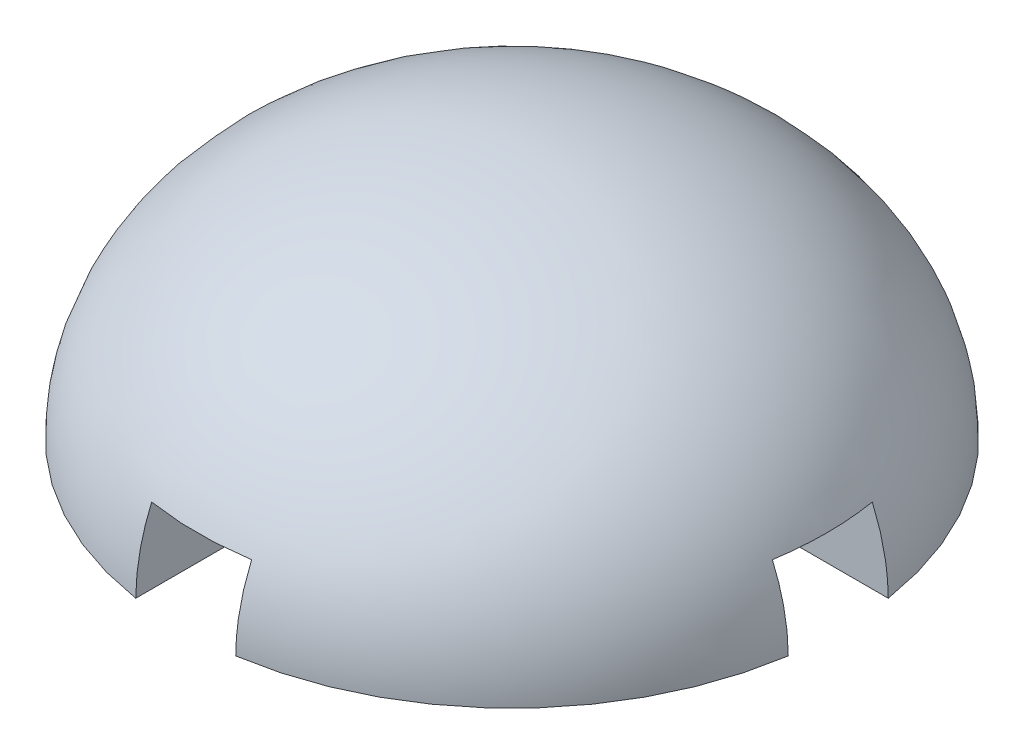
ISO-10303-21;
HEADER;
FILE_DESCRIPTION(('STEP AP214'),'2;1');
FILE_NAME('part.step','',(''),(''),'','','');
FILE_SCHEMA(('AUTOMOTIVE_DESIGN { 1 0 10303 214 1 1 1 1 }'));
ENDSEC;
DATA;
#1=APPLICATION_CONTEXT('core data for automotive mechanical design processes');
#2=APPLICATION_PROTOCOL_DEFINITION('international standard','automotive_design',2000,#1);
#3=PRODUCT_CONTEXT('',#1,'mechanical');
#4=PRODUCT('Part','Part','',(#3));
#5=PRODUCT_RELATED_PRODUCT_CATEGORY('part','',(#4));
#6=PRODUCT_DEFINITION_FORMATION('','',#4);
#7=PRODUCT_DEFINITION_CONTEXT('part definition',#1,'design');
#8=PRODUCT_DEFINITION('design','',#6,#7);
#9=PRODUCT_DEFINITION_SHAPE('','',#8);
#10=(LENGTH_UNIT() NAMED_UNIT(*) SI_UNIT(.MILLI.,.METRE.));
#11=(NAMED_UNIT(*) PLANE_ANGLE_UNIT() SI_UNIT($,.RADIAN.));
#12=(NAMED_UNIT(*) SI_UNIT($,.STERADIAN.) SOLID_ANGLE_UNIT());
#13=UNCERTAINTY_MEASURE_WITH_UNIT(LENGTH_MEASURE(1.E-05),#10,'distance_accuracy_value','');
#14=(GEOMETRIC_REPRESENTATION_CONTEXT(3) GLOBAL_UNCERTAINTY_ASSIGNED_CONTEXT((#13)) GLOBAL_UNIT_ASSIGNED_CONTEXT((#10,
#11,#12)) REPRESENTATION_CONTEXT('',''));
#15=CARTESIAN_POINT('',(0.,0.,0.));
#16=DIRECTION('',(0.,0.,1.));
#17=DIRECTION('',(1.,0.,0.));
#18=AXIS2_PLACEMENT_3D('',#15,#16,#17);
#19=CARTESIAN_POINT('',(17.5,1.640625,0.));
#20=DIRECTION('',(0.,-1.,0.));
#21=DIRECTION('',(0.,0.,-1.));
#22=AXIS2_PLACEMENT_3D('',#19,#20,#21);
#23=PLANE('',#22);
#24=CARTESIAN_POINT('',(0.,1.640625,0.));
#25=DIRECTION('',(0.,-1.,0.));
#26=DIRECTION('',(0.,0.,-1.));
#27=AXIS2_PLACEMENT_3D('',#24,#25,#26);
#28=CIRCLE('',#27,17.5);
#29=CARTESIAN_POINT('',(2.65,1.640625,-17.2981935473043));
#30=VERTEX_POINT('',#29);
#31=CARTESIAN_POINT('',(17.2981935473043,1.640625,-2.65000000000006));
#32=VERTEX_POINT('',#31);
#33=EDGE_CURVE('E150',#30,#32,#28,.T.);
#34=ORIENTED_EDGE('',*,*,#33,.T.);
#35=DIRECTION('',(-1.,0.,0.));
#36=VECTOR('',#35,1.);
#37=CARTESIAN_POINT('',(17.5,1.640625,-2.65000000000006));
#38=LINE('',#37,#36);
#39=CARTESIAN_POINT('',(2.65,1.640625,-2.65000000000001));
#40=VERTEX_POINT('',#39);
#41=EDGE_CURVE('E264',#32,#40,#38,.T.);
#42=ORIENTED_EDGE('',*,*,#41,.T.);
#43=DIRECTION('',(0.,0.,-1.));
#44=VECTOR('',#43,1.);
#45=CARTESIAN_POINT('',(2.65,1.640625,17.5));
#46=LINE('',#45,#44);
#47=EDGE_CURVE('E164',#40,#30,#46,.T.);
#48=ORIENTED_EDGE('',*,*,#47,.T.);
#49=EDGE_LOOP('',(#34,#42,#48));
#50=FACE_BOUND('',#49,.T.);
#51=ADVANCED_FACE('F35',(#50),#23,.T.);
#52=CARTESIAN_POINT('',(2.65,1.640625,17.2981935473043));
#53=VERTEX_POINT('',#52);
#54=CARTESIAN_POINT('',(2.65,1.640625,2.64999999999999));
#55=VERTEX_POINT('',#54);
#56=EDGE_CURVE('E144',#53,#55,#46,.T.);
#57=ORIENTED_EDGE('',*,*,#56,.T.);
#58=DIRECTION('',(-1.,0.,0.));
#59=VECTOR('',#58,1.);
#60=CARTESIAN_POINT('',(17.5,1.640625,2.64999999999994));
#61=LINE('',#60,#59);
#62=CARTESIAN_POINT('',(17.2981935473043,1.640625,2.64999999999994));
#63=VERTEX_POINT('',#62);
#64=EDGE_CURVE('E53',#63,#55,#61,.T.);
#65=ORIENTED_EDGE('',*,*,#64,.F.);
#66=EDGE_CURVE('E142',#63,#53,#28,.T.);
#67=ORIENTED_EDGE('',*,*,#66,.T.);
#68=EDGE_LOOP('',(#57,#65,#67));
#69=FACE_BOUND('',#68,.T.);
#70=ADVANCED_FACE('F141',(#69),#23,.T.);
#71=DIRECTION('',(0.,0.,-1.));
#72=VECTOR('',#71,1.);
#73=CARTESIAN_POINT('',(-2.65,1.640625,17.5));
#74=LINE('',#73,#72);
#75=CARTESIAN_POINT('',(-2.65,1.640625,-2.64999999999999));
#76=VERTEX_POINT('',#75);
#77=CARTESIAN_POINT('',(-2.65,1.640625,-17.2981935473043));
#78=VERTEX_POINT('',#77);
#79=EDGE_CURVE('E177',#76,#78,#74,.T.);
#80=ORIENTED_EDGE('',*,*,#79,.F.);
#81=CARTESIAN_POINT('',(-17.2981935473043,1.640625,-2.64999999999994));
#82=VERTEX_POINT('',#81);
#83=EDGE_CURVE('E308',#76,#82,#38,.T.);
#84=ORIENTED_EDGE('',*,*,#83,.T.);
#85=EDGE_CURVE('E153',#82,#78,#28,.T.);
#86=ORIENTED_EDGE('',*,*,#85,.T.);
#87=EDGE_LOOP('',(#80,#84,#86));
#88=FACE_BOUND('',#87,.T.);
#89=ADVANCED_FACE('F248',(#88),#23,.T.);
#90=CARTESIAN_POINT('',(-2.65,1.640625,17.2981935473043));
#91=VERTEX_POINT('',#90);
#92=CARTESIAN_POINT('',(-17.2981935473043,1.640625,2.65000000000006));
#93=VERTEX_POINT('',#92);
#94=EDGE_CURVE('E151',#91,#93,#28,.T.);
#95=ORIENTED_EDGE('',*,*,#94,.T.);
#96=CARTESIAN_POINT('',(-2.65,1.640625,2.65000000000001));
#97=VERTEX_POINT('',#96);
#98=EDGE_CURVE('E145',#97,#93,#61,.T.);
#99=ORIENTED_EDGE('',*,*,#98,.F.);
#100=EDGE_CURVE('E174',#91,#97,#74,.T.);
#101=ORIENTED_EDGE('',*,*,#100,.F.);
#102=EDGE_LOOP('',(#95,#99,#101));
#103=FACE_BOUND('',#102,.T.);
#104=ADVANCED_FACE('F244',(#103),#23,.T.);
#105=CARTESIAN_POINT('',(0.,-11.484375,0.));
#106=CARTESIAN_POINT('',(0.,-11.484375,0.));
#107=CARTESIAN_POINT('',(0.,-11.484375,0.));
#108=CARTESIAN_POINT('',(0.,-11.484375,0.));
#109=CARTESIAN_POINT('',(0.,-11.484375,0.));
#110=CARTESIAN_POINT('',(0.,-11.484375,0.));
#111=CARTESIAN_POINT('',(0.,-11.484375,0.));
#112=CARTESIAN_POINT('',(35.,-11.484375,0.));
#113=CARTESIAN_POINT('',(35.,-11.484375,70.));
#114=CARTESIAN_POINT('',(-35.,-11.484375,70.));
#115=CARTESIAN_POINT('',(-35.,-11.484375,0.));
#116=CARTESIAN_POINT('',(-35.,-11.484375,-70.));
#117=CARTESIAN_POINT('',(35.,-11.484375,-70.));
#118=CARTESIAN_POINT('',(35.,-11.484375,0.));
#119=CARTESIAN_POINT('',(35.,14.765625,0.));
#120=CARTESIAN_POINT('',(35.,14.765625,70.));
#121=CARTESIAN_POINT('',(-35.,14.765625,70.));
#122=CARTESIAN_POINT('',(-35.,14.765625,0.));
#123=CARTESIAN_POINT('',(-35.,14.765625,-70.));
#124=CARTESIAN_POINT('',(35.,14.765625,-70.));
#125=CARTESIAN_POINT('',(35.,14.765625,0.));
#126=CARTESIAN_POINT('',(0.,14.765625,0.));
#127=CARTESIAN_POINT('',(0.,14.765625,0.));
#128=CARTESIAN_POINT('',(0.,14.765625,0.));
#129=CARTESIAN_POINT('',(0.,14.765625,0.));
#130=CARTESIAN_POINT('',(0.,14.765625,0.));
#131=CARTESIAN_POINT('',(0.,14.765625,0.));
#132=CARTESIAN_POINT('',(0.,14.765625,0.));
#133=(BOUNDED_SURFACE() B_SPLINE_SURFACE(3,3,((#105,#106,#107,#108,#109,#110,#111),(#112,#113,
#114,#115,#116,#117,#118),(#119,#120,#121,#122,#123,#124,#125),(#126,#127,#128,#129,#130,#131,
#132)),.UNSPECIFIED.,.F.,.T.,.F.) B_SPLINE_SURFACE_WITH_KNOTS((4,4),(4,3,4),(0.,1.),(0.,0.5,1.),
.UNSPECIFIED.) GEOMETRIC_REPRESENTATION_ITEM() RATIONAL_B_SPLINE_SURFACE(((1.,0.333333333333333,
0.333333333333333,1.,0.333333333333333,0.333333333333333,1.),(0.333333333333333,
0.111111111111111,0.111111111111111,0.333333333333333,0.111111111111111,0.111111111111111,
0.333333333333333),(0.333333333333333,0.111111111111111,0.111111111111111,0.333333333333333,
0.111111111111111,0.111111111111111,0.333333333333333),(1.,0.333333333333333,0.333333333333333,
1.,0.333333333333333,0.333333333333333,1.))) REPRESENTATION_ITEM('') SURFACE());
#134=CARTESIAN_POINT('',(0.,5.640625,0.));
#135=DIRECTION('',(0.,-1.,0.));
#136=DIRECTION('',(0.,0.,-1.));
#137=AXIS2_PLACEMENT_3D('',#134,#135,#136);
#138=CIRCLE('',#137,16.6674999791677);
#139=CARTESIAN_POINT('',(16.4554870956637,5.640625,2.64999999999994));
#140=VERTEX_POINT('',#139);
#141=CARTESIAN_POINT('',(16.4554870956637,5.640625,-2.65000000000006));
#142=VERTEX_POINT('',#141);
#143=EDGE_CURVE('E136',#140,#142,#138,.F.);
#144=CARTESIAN_POINT('',(16.4554870956637,5.640625,-2.65000000000005));
#145=CARTESIAN_POINT('',(16.5122194286375,5.50934431640797,-2.65000000000006));
#146=CARTESIAN_POINT('',(16.5663443367128,5.37695169892692,-2.65000000000006));
#147=CARTESIAN_POINT('',(16.6692086741272,5.11007785896755,-2.65000000000006));
#148=CARTESIAN_POINT('',(16.7179476246503,4.97559645200435,-2.65000000000006));
#149=CARTESIAN_POINT('',(16.8558893774968,4.56903836973949,-2.65000000000006));
#150=CARTESIAN_POINT('',(16.9367248065236,4.29406050323443,-2.65000000000006));
#151=CARTESIAN_POINT('',(17.0735544744231,3.74309695978733,-2.65000000000006));
#152=CARTESIAN_POINT('',(17.1299559440354,3.46721181567072,-2.65000000000006));
#153=CARTESIAN_POINT('',(17.2189905071241,2.91180857006725,-2.65000000000006));
#154=CARTESIAN_POINT('',(17.2516440086653,2.63229379852594,-2.65000000000006));
#155=CARTESIAN_POINT('',(17.2808228022743,2.23383625725754,-2.65000000000006));
#156=CARTESIAN_POINT('',(17.2873202697918,2.11555541744499,-2.65000000000006));
#157=CARTESIAN_POINT('',(17.2960136906213,1.87839683161359,-2.65000000000006));
#158=CARTESIAN_POINT('',(17.2981936126329,1.75951849802274,-2.65000000000006));
#159=CARTESIAN_POINT('',(17.2981935473043,1.640625,-2.65000000000006));
#160=B_SPLINE_CURVE_WITH_KNOTS('',3,(#144,#145,#146,#147,#148,#149,#150,#151,#152,#153,#154,
#155,#156,#157,#158,#159),.UNSPECIFIED.,.F.,.F.,(4,2,2,2,2,2,2,4),(0.,0.428985934524809,
0.858009975615042,1.716751455127,2.56057157962215,3.4036656988418,3.75897918085681,
4.11560950770023),.UNSPECIFIED.);
#161=EDGE_CURVE('E186',#142,#32,#160,.T.);
#162=CARTESIAN_POINT('',(2.65,1.640625,-17.2981935473043));
#163=CARTESIAN_POINT('',(2.65,1.78368796100522,-17.2981954235256));
#164=CARTESIAN_POINT('',(2.65,1.92673125591767,-17.2950375383726));
#165=CARTESIAN_POINT('',(2.65,2.21253712131983,-17.2824292273807));
#166=CARTESIAN_POINT('',(2.65,2.35529969810585,-17.2729789443284));
#167=CARTESIAN_POINT('',(2.65,2.78277041685377,-17.2352336042441));
#168=CARTESIAN_POINT('',(2.65,3.06670547057372,-17.1975440400968));
#169=CARTESIAN_POINT('',(2.65,3.62556366035251,-17.0986000455381));
#170=CARTESIAN_POINT('',(2.65,3.90055822151594,-17.037742474687));
#171=CARTESIAN_POINT('',(2.65,4.44443038595402,-16.8934408593946));
#172=CARTESIAN_POINT('',(2.65000000000001,4.71331119860454,-16.8100089764953));
#173=CARTESIAN_POINT('',(2.65,5.08993874586,-16.6763207220733));
#174=CARTESIAN_POINT('',(2.65,5.20086436732454,-16.6348161724449));
#175=CARTESIAN_POINT('',(2.65,5.42166008900172,-16.5479789536719));
#176=CARTESIAN_POINT('',(2.65,5.53152507432968,-16.5026332756449));
#177=CARTESIAN_POINT('',(2.65,5.640625,-16.4554870956637));
#178=B_SPLINE_CURVE_WITH_KNOTS('',3,(#162,#163,#164,#165,#166,#167,#168,#169,#170,#171,#172,
#173,#174,#175,#176,#177),.UNSPECIFIED.,.F.,.F.,(4,2,2,2,2,2,2,4),(0.,0.429115102415555,
0.858220467714373,1.71629988793789,2.56029785281974,3.40384202980446,3.75909841132885,
4.11561013471824),.UNSPECIFIED.);
#179=CARTESIAN_POINT('',(2.65,5.640625,-16.4554870956637));
#180=VERTEX_POINT('',#179);
#181=EDGE_CURVE('E228',#30,#180,#178,.T.);
#182=CARTESIAN_POINT('',(0.,5.640625,0.));
#183=DIRECTION('',(0.,-1.,0.));
#184=DIRECTION('',(0.,0.,-1.));
#185=AXIS2_PLACEMENT_3D('',#182,#183,#184);
#186=CIRCLE('',#185,16.6674999791677);
#187=CARTESIAN_POINT('',(-2.65,5.640625,-16.4554870956637));
#188=VERTEX_POINT('',#187);
#189=EDGE_CURVE('E289',#180,#188,#186,.F.);
#190=CARTESIAN_POINT('',(-2.65,5.640625,-16.4554870956637));
#191=CARTESIAN_POINT('',(-2.65,5.50934431640796,-16.5122194286375));
#192=CARTESIAN_POINT('',(-2.65,5.37695169892692,-16.5663443367128));
#193=CARTESIAN_POINT('',(-2.65,5.11007785896755,-16.6692086741272));
#194=CARTESIAN_POINT('',(-2.65,4.97559645200435,-16.7179476246503));
#195=CARTESIAN_POINT('',(-2.65,4.56903836973949,-16.8558893774968));
#196=CARTESIAN_POINT('',(-2.65,4.29406050323443,-16.9367248065236));
#197=CARTESIAN_POINT('',(-2.65,3.74309695978733,-17.0735544744231));
#198=CARTESIAN_POINT('',(-2.65,3.46721181567072,-17.1299559440354));
#199=CARTESIAN_POINT('',(-2.65,2.91180857006724,-17.2189905071241));
#200=CARTESIAN_POINT('',(-2.65,2.63229379852593,-17.2516440086653));
#201=CARTESIAN_POINT('',(-2.65,2.23383625725753,-17.2808228022743));
#202=CARTESIAN_POINT('',(-2.65,2.11555541744499,-17.2873202697918));
#203=CARTESIAN_POINT('',(-2.65,1.87839683161359,-17.2960136906213));
#204=CARTESIAN_POINT('',(-2.65,1.75951849802274,-17.2981936126329));
#205=CARTESIAN_POINT('',(-2.65,1.640625,-17.2981935473043));
#206=B_SPLINE_CURVE_WITH_KNOTS('',3,(#190,#191,#192,#193,#194,#195,#196,#197,#198,#199,#200,
#201,#202,#203,#204,#205),.UNSPECIFIED.,.F.,.F.,(4,2,2,2,2,2,2,4),(0.,0.428985934524806,
0.858009975615042,1.716751455127,2.56057157962215,3.40366569884181,3.75897918085681,
4.11560950770022),.UNSPECIFIED.);
#207=EDGE_CURVE('E155',#188,#78,#206,.T.);
#208=CARTESIAN_POINT('',(-17.2981935473043,1.640625,-2.64999999999994));
#209=CARTESIAN_POINT('',(-17.2981954235257,1.78368796100522,-2.64999999999994));
#210=CARTESIAN_POINT('',(-17.2950375383727,1.92673125591767,-2.64999999999994));
#211=CARTESIAN_POINT('',(-17.2824292273807,2.21253712131983,-2.64999999999994));
#212=CARTESIAN_POINT('',(-17.2729789443284,2.35529969810585,-2.64999999999994));
#213=CARTESIAN_POINT('',(-17.2352336042441,2.78277041685377,-2.64999999999994));
#214=CARTESIAN_POINT('',(-17.1975440400968,3.06670547057372,-2.64999999999994));
#215=CARTESIAN_POINT('',(-17.0986000455381,3.62556366035251,-2.64999999999994));
#216=CARTESIAN_POINT('',(-17.037742474687,3.90055822151593,-2.64999999999994));
#217=CARTESIAN_POINT('',(-16.8934408593946,4.44443038595401,-2.64999999999994));
#218=CARTESIAN_POINT('',(-16.8100089764954,4.71331119860454,-2.64999999999993));
#219=CARTESIAN_POINT('',(-16.6763207220734,5.08993874586,-2.64999999999994));
#220=CARTESIAN_POINT('',(-16.6348161724449,5.20086436732454,-2.64999999999994));
#221=CARTESIAN_POINT('',(-16.5479789536719,5.42166008900172,-2.64999999999994));
#222=CARTESIAN_POINT('',(-16.5026332756449,5.53152507432968,-2.64999999999994));
#223=CARTESIAN_POINT('',(-16.4554870956637,5.640625,-2.64999999999994));
#224=B_SPLINE_CURVE_WITH_KNOTS('',3,(#208,#209,#210,#211,#212,#213,#214,#215,#216,#217,#218,
#219,#220,#221,#222,#223),.UNSPECIFIED.,.F.,.F.,(4,2,2,2,2,2,2,4),(0.,0.429115102415554,
0.858220467714371,1.71629988793789,2.56029785281974,3.40384202980446,3.75909841132885,
4.11561013471824),.UNSPECIFIED.);
#225=CARTESIAN_POINT('',(-16.4554870956637,5.640625,-2.64999999999994));
#226=VERTEX_POINT('',#225);
#227=EDGE_CURVE('E178',#82,#226,#224,.T.);
#228=CARTESIAN_POINT('',(-16.4554870956637,5.640625,2.65000000000006));
#229=VERTEX_POINT('',#228);
#230=EDGE_CURVE('E261',#226,#229,#138,.F.);
#231=CARTESIAN_POINT('',(-16.4554870956637,5.640625,2.65000000000006));
#232=CARTESIAN_POINT('',(-16.5122194286375,5.50934431640796,2.65000000000006));
#233=CARTESIAN_POINT('',(-16.5663443367128,5.37695169892692,2.65000000000006));
#234=CARTESIAN_POINT('',(-16.6692086741272,5.11007785896754,2.65000000000006));
#235=CARTESIAN_POINT('',(-16.7179476246503,4.97559645200434,2.65000000000006));
#236=CARTESIAN_POINT('',(-16.8558893774968,4.56903836973949,2.65000000000006));
#237=CARTESIAN_POINT('',(-16.9367248065236,4.29406050323443,2.65000000000006));
#238=CARTESIAN_POINT('',(-17.0735544744231,3.74309695978733,2.65000000000006));
#239=CARTESIAN_POINT('',(-17.1299559440354,3.46721181567071,2.65000000000006));
#240=CARTESIAN_POINT('',(-17.2189905071241,2.91180857006724,2.65000000000006));
#241=CARTESIAN_POINT('',(-17.2516440086653,2.63229379852593,2.65000000000006));
#242=CARTESIAN_POINT('',(-17.2808228022743,2.23383625725753,2.65000000000006));
#243=CARTESIAN_POINT('',(-17.2873202697918,2.11555541744499,2.65000000000006));
#244=CARTESIAN_POINT('',(-17.2960136906213,1.87839683161359,2.65000000000006));
#245=CARTESIAN_POINT('',(-17.2981936126329,1.75951849802274,2.65000000000006));
#246=CARTESIAN_POINT('',(-17.2981935473043,1.640625,2.65000000000007));
#247=B_SPLINE_CURVE_WITH_KNOTS('',3,(#231,#232,#233,#234,#235,#236,#237,#238,#239,#240,#241,
#242,#243,#244,#245,#246),.UNSPECIFIED.,.F.,.F.,(4,2,2,2,2,2,2,4),(0.,0.42898593452481,
0.858009975615044,1.716751455127,2.56057157962215,3.40366569884181,3.75897918085681,
4.11560950770022),.UNSPECIFIED.);
#248=EDGE_CURVE('E137',#229,#93,#247,.T.);
#249=CARTESIAN_POINT('',(-2.65,1.640625,17.2981935473043));
#250=CARTESIAN_POINT('',(-2.65,1.78368796100522,17.2981954235256));
#251=CARTESIAN_POINT('',(-2.65,1.92673125591767,17.2950375383726));
#252=CARTESIAN_POINT('',(-2.65,2.21253712131983,17.2824292273807));
#253=CARTESIAN_POINT('',(-2.65,2.35529969810585,17.2729789443284));
#254=CARTESIAN_POINT('',(-2.65,2.78277041685377,17.2352336042441));
#255=CARTESIAN_POINT('',(-2.65,3.06670547057372,17.1975440400968));
#256=CARTESIAN_POINT('',(-2.65,3.62556366035251,17.0986000455381));
#257=CARTESIAN_POINT('',(-2.65,3.90055822151594,17.037742474687));
#258=CARTESIAN_POINT('',(-2.65,4.44443038595402,16.8934408593946));
#259=CARTESIAN_POINT('',(-2.65000000000001,4.71331119860454,16.8100089764953));
#260=CARTESIAN_POINT('',(-2.65,5.08993874586,16.6763207220733));
#261=CARTESIAN_POINT('',(-2.65,5.20086436732454,16.6348161724449));
#262=CARTESIAN_POINT('',(-2.65,5.42166008900172,16.5479789536719));
#263=CARTESIAN_POINT('',(-2.65,5.53152507432968,16.5026332756449));
#264=CARTESIAN_POINT('',(-2.65,5.640625,16.4554870956637));
#265=B_SPLINE_CURVE_WITH_KNOTS('',3,(#249,#250,#251,#252,#253,#254,#255,#256,#257,#258,#259,
#260,#261,#262,#263,#264),.UNSPECIFIED.,.F.,.F.,(4,2,2,2,2,2,2,4),(0.,0.429115102415555,
0.858220467714371,1.71629988793789,2.56029785281974,3.40384202980446,3.75909841132885,
4.11561013471824),.UNSPECIFIED.);
#266=CARTESIAN_POINT('',(-2.65,5.640625,16.4554870956637));
#267=VERTEX_POINT('',#266);
#268=EDGE_CURVE('E219',#91,#267,#265,.T.);
#269=CARTESIAN_POINT('',(2.65,5.640625,16.4554870956637));
#270=VERTEX_POINT('',#269);
#271=EDGE_CURVE('E227',#267,#270,#186,.F.);
#272=CARTESIAN_POINT('',(2.65,5.640625,16.4554870956637));
#273=CARTESIAN_POINT('',(2.65,5.50934431640796,16.5122194286375));
#274=CARTESIAN_POINT('',(2.65,5.37695169892692,16.5663443367128));
#275=CARTESIAN_POINT('',(2.65,5.11007785896754,16.6692086741273));
#276=CARTESIAN_POINT('',(2.65,4.97559645200435,16.7179476246503));
#277=CARTESIAN_POINT('',(2.65,4.56903836973949,16.8558893774968));
#278=CARTESIAN_POINT('',(2.65,4.29406050323443,16.9367248065236));
#279=CARTESIAN_POINT('',(2.65,3.74309695978733,17.0735544744231));
#280=CARTESIAN_POINT('',(2.65,3.46721181567072,17.1299559440355));
#281=CARTESIAN_POINT('',(2.65,2.91180857006725,17.2189905071241));
#282=CARTESIAN_POINT('',(2.65,2.63229379852593,17.2516440086653));
#283=CARTESIAN_POINT('',(2.65,2.23383625725753,17.2808228022743));
#284=CARTESIAN_POINT('',(2.65,2.11555541744499,17.2873202697918));
#285=CARTESIAN_POINT('',(2.65,1.87839683161359,17.2960136906213));
#286=CARTESIAN_POINT('',(2.65,1.75951849802274,17.2981936126329));
#287=CARTESIAN_POINT('',(2.65,1.640625,17.2981935473043));
#288=B_SPLINE_CURVE_WITH_KNOTS('',3,(#272,#273,#274,#275,#276,#277,#278,#279,#280,#281,#282,
#283,#284,#285,#286,#287),.UNSPECIFIED.,.F.,.F.,(4,2,2,2,2,2,2,4),(0.,0.42898593452481,
0.858009975615046,1.716751455127,2.56057157962215,3.40366569884181,3.75897918085682,
4.11560950770023),.UNSPECIFIED.);
#289=EDGE_CURVE('E149',#270,#53,#288,.T.);
#290=CARTESIAN_POINT('',(17.2981935473043,1.640625,2.64999999999994));
#291=CARTESIAN_POINT('',(17.2981954235257,1.78368796100522,2.64999999999994));
#292=CARTESIAN_POINT('',(17.2950375383727,1.92673125591767,2.64999999999994));
#293=CARTESIAN_POINT('',(17.2824292273807,2.21253712131983,2.64999999999994));
#294=CARTESIAN_POINT('',(17.2729789443284,2.35529969810585,2.64999999999994));
#295=CARTESIAN_POINT('',(17.2352336042441,2.78277041685377,2.64999999999994));
#296=CARTESIAN_POINT('',(17.1975440400968,3.06670547057371,2.64999999999994));
#297=CARTESIAN_POINT('',(17.0986000455381,3.6255636603525,2.64999999999994));
#298=CARTESIAN_POINT('',(17.037742474687,3.90055822151593,2.64999999999994));
#299=CARTESIAN_POINT('',(16.8934408593946,4.44443038595401,2.64999999999994));
#300=CARTESIAN_POINT('',(16.8100089764953,4.71331119860454,2.64999999999994));
#301=CARTESIAN_POINT('',(16.6763207220734,5.08993874586,2.64999999999994));
#302=CARTESIAN_POINT('',(16.634816172445,5.20086436732454,2.64999999999994));
#303=CARTESIAN_POINT('',(16.5479789536719,5.42166008900172,2.64999999999994));
#304=CARTESIAN_POINT('',(16.5026332756449,5.53152507432968,2.64999999999994));
#305=CARTESIAN_POINT('',(16.4554870956637,5.640625,2.64999999999994));
#306=B_SPLINE_CURVE_WITH_KNOTS('',3,(#290,#291,#292,#293,#294,#295,#296,#297,#298,#299,#300,
#301,#302,#303,#304,#305),.UNSPECIFIED.,.F.,.F.,(4,2,2,2,2,2,2,4),(0.,0.429115102415555,
0.858220467714372,1.71629988793789,2.56029785281974,3.40384202980446,3.75909841132885,
4.11561013471824),.UNSPECIFIED.);
#307=EDGE_CURVE('E129',#63,#140,#306,.T.);
#308=CARTESIAN_POINT('',(0.,14.765625,0.));
#309=VERTEX_POINT('',#308);
#310=VERTEX_LOOP('',#309);
#311=FACE_BOUND('',#310,.T.);
#312=ORIENTED_EDGE('',*,*,#143,.T.);
#313=ORIENTED_EDGE('',*,*,#161,.T.);
#314=ORIENTED_EDGE('',*,*,#33,.F.);
#315=ORIENTED_EDGE('',*,*,#181,.T.);
#316=ORIENTED_EDGE('',*,*,#189,.T.);
#317=ORIENTED_EDGE('',*,*,#207,.T.);
#318=ORIENTED_EDGE('',*,*,#85,.F.);
#319=ORIENTED_EDGE('',*,*,#227,.T.);
#320=ORIENTED_EDGE('',*,*,#230,.T.);
#321=ORIENTED_EDGE('',*,*,#248,.T.);
#322=ORIENTED_EDGE('',*,*,#94,.F.);
#323=ORIENTED_EDGE('',*,*,#268,.T.);
#324=ORIENTED_EDGE('',*,*,#271,.T.);
#325=ORIENTED_EDGE('',*,*,#289,.T.);
#326=ORIENTED_EDGE('',*,*,#66,.F.);
#327=ORIENTED_EDGE('',*,*,#307,.T.);
#328=EDGE_LOOP('',(#312,#313,#314,#315,#316,#317,#318,#319,#320,#321,#322,#323,#324,#325,#326,#327));
#329=FACE_BOUND('',#328,.T.);
#330=ADVANCED_FACE('F37',(#311,#329),#133,.T.);
#331=CARTESIAN_POINT('',(2.65,5.640625,17.5));
#332=DIRECTION('',(-1.,0.,0.));
#333=DIRECTION('',(0.,0.,1.));
#334=AXIS2_PLACEMENT_3D('',#331,#332,#333);
#335=PLANE('',#334);
#336=ORIENTED_EDGE('',*,*,#47,.F.);
#337=DIRECTION('',(0.,1.,0.));
#338=VECTOR('',#337,1.);
#339=CARTESIAN_POINT('',(2.65,5.640625,-2.65000000000001));
#340=LINE('',#339,#338);
#341=CARTESIAN_POINT('',(2.65,5.640625,-2.65000000000001));
#342=VERTEX_POINT('',#341);
#343=EDGE_CURVE('E276',#40,#342,#340,.T.);
#344=ORIENTED_EDGE('',*,*,#343,.T.);
#345=DIRECTION('',(0.,0.,-1.));
#346=VECTOR('',#345,1.);
#347=CARTESIAN_POINT('',(2.65,5.640625,17.5));
#348=LINE('',#347,#346);
#349=EDGE_CURVE('E169',#342,#180,#348,.T.);
#350=ORIENTED_EDGE('',*,*,#349,.T.);
#351=ORIENTED_EDGE('',*,*,#181,.F.);
#352=EDGE_LOOP('',(#336,#344,#350,#351));
#353=FACE_BOUND('',#352,.T.);
#354=ADVANCED_FACE('F237',(#353),#335,.T.);
#355=CARTESIAN_POINT('',(2.65,5.640625,2.64999999999999));
#356=VERTEX_POINT('',#355);
#357=EDGE_CURVE('E165',#270,#356,#348,.T.);
#358=ORIENTED_EDGE('',*,*,#357,.T.);
#359=DIRECTION('',(0.,-1.,0.));
#360=VECTOR('',#359,1.);
#361=CARTESIAN_POINT('',(2.65,5.640625,2.64999999999999));
#362=LINE('',#361,#360);
#363=EDGE_CURVE('E262',#356,#55,#362,.T.);
#364=ORIENTED_EDGE('',*,*,#363,.T.);
#365=ORIENTED_EDGE('',*,*,#56,.F.);
#366=ORIENTED_EDGE('',*,*,#289,.F.);
#367=EDGE_LOOP('',(#358,#364,#365,#366));
#368=FACE_BOUND('',#367,.T.);
#369=ADVANCED_FACE('F208',(#368),#335,.T.);
#370=CARTESIAN_POINT('',(-2.65,5.640625,17.5));
#371=DIRECTION('',(1.,0.,0.));
#372=DIRECTION('',(0.,0.,-1.));
#373=AXIS2_PLACEMENT_3D('',#370,#371,#372);
#374=PLANE('',#373);
#375=DIRECTION('',(0.,0.,-1.));
#376=VECTOR('',#375,1.);
#377=CARTESIAN_POINT('',(-2.65,5.640625,17.5));
#378=LINE('',#377,#376);
#379=CARTESIAN_POINT('',(-2.65,5.640625,-2.64999999999999));
#380=VERTEX_POINT('',#379);
#381=EDGE_CURVE('E173',#380,#188,#378,.T.);
#382=ORIENTED_EDGE('',*,*,#381,.F.);
#383=DIRECTION('',(0.,-1.,0.));
#384=VECTOR('',#383,1.);
#385=CARTESIAN_POINT('',(-2.65,5.640625,-2.64999999999999));
#386=LINE('',#385,#384);
#387=EDGE_CURVE('E11',#380,#76,#386,.T.);
#388=ORIENTED_EDGE('',*,*,#387,.T.);
#389=ORIENTED_EDGE('',*,*,#79,.T.);
#390=ORIENTED_EDGE('',*,*,#207,.F.);
#391=EDGE_LOOP('',(#382,#388,#389,#390));
#392=FACE_BOUND('',#391,.T.);
#393=ADVANCED_FACE('F202',(#392),#374,.T.);
#394=ORIENTED_EDGE('',*,*,#100,.T.);
#395=DIRECTION('',(0.,1.,0.));
#396=VECTOR('',#395,1.);
#397=CARTESIAN_POINT('',(-2.65,5.640625,2.65000000000001));
#398=LINE('',#397,#396);
#399=CARTESIAN_POINT('',(-2.65,5.640625,2.65000000000001));
#400=VERTEX_POINT('',#399);
#401=EDGE_CURVE('E46',#97,#400,#398,.T.);
#402=ORIENTED_EDGE('',*,*,#401,.T.);
#403=EDGE_CURVE('E170',#267,#400,#378,.T.);
#404=ORIENTED_EDGE('',*,*,#403,.F.);
#405=ORIENTED_EDGE('',*,*,#268,.F.);
#406=EDGE_LOOP('',(#394,#402,#404,#405));
#407=FACE_BOUND('',#406,.T.);
#408=ADVANCED_FACE('F207',(#407),#374,.T.);
#409=CARTESIAN_POINT('',(-2.65,5.640625,17.5));
#410=DIRECTION('',(0.,-1.,0.));
#411=DIRECTION('',(0.,0.,-1.));
#412=AXIS2_PLACEMENT_3D('',#409,#410,#411);
#413=PLANE('',#412);
#414=CARTESIAN_POINT('',(0.,5.640625,0.));
#415=DIRECTION('',(0.,-1.,0.));
#416=DIRECTION('',(0.,0.,-1.));
#417=AXIS2_PLACEMENT_3D('',#414,#415,#416);
#418=CIRCLE('',#417,2.5);
#419=CARTESIAN_POINT('',(0.,5.640625,-2.5));
#420=VERTEX_POINT('',#419);
#421=EDGE_CURVE('E298',#420,#420,#418,.T.);
#422=ORIENTED_EDGE('',*,*,#421,.F.);
#423=EDGE_LOOP('',(#422));
#424=FACE_BOUND('',#423,.T.);
#425=DIRECTION('',(-1.,0.,0.));
#426=VECTOR('',#425,1.);
#427=CARTESIAN_POINT('',(17.5,5.640625,-2.65000000000006));
#428=LINE('',#427,#426);
#429=EDGE_CURVE('E305',#380,#226,#428,.T.);
#430=ORIENTED_EDGE('',*,*,#429,.F.);
#431=ORIENTED_EDGE('',*,*,#381,.T.);
#432=ORIENTED_EDGE('',*,*,#189,.F.);
#433=ORIENTED_EDGE('',*,*,#349,.F.);
#434=EDGE_CURVE('E307',#142,#342,#428,.T.);
#435=ORIENTED_EDGE('',*,*,#434,.F.);
#436=ORIENTED_EDGE('',*,*,#143,.F.);
#437=DIRECTION('',(-1.,0.,0.));
#438=VECTOR('',#437,1.);
#439=CARTESIAN_POINT('',(17.5,5.640625,2.64999999999994));
#440=LINE('',#439,#438);
#441=EDGE_CURVE('E132',#140,#356,#440,.T.);
#442=ORIENTED_EDGE('',*,*,#441,.T.);
#443=ORIENTED_EDGE('',*,*,#357,.F.);
#444=ORIENTED_EDGE('',*,*,#271,.F.);
#445=ORIENTED_EDGE('',*,*,#403,.T.);
#446=EDGE_CURVE('E61',#400,#229,#440,.T.);
#447=ORIENTED_EDGE('',*,*,#446,.T.);
#448=ORIENTED_EDGE('',*,*,#230,.F.);
#449=EDGE_LOOP('',(#430,#431,#432,#433,#435,#436,#442,#443,#444,#445,#447,#448));
#450=FACE_BOUND('',#449,.T.);
#451=ADVANCED_FACE('F210',(#424,#450),#413,.T.);
#452=CARTESIAN_POINT('',(17.5,5.640625,2.64999999999994));
#453=DIRECTION('',(0.,0.,-1.));
#454=DIRECTION('',(-1.,0.,0.));
#455=AXIS2_PLACEMENT_3D('',#452,#453,#454);
#456=PLANE('',#455);
#457=ORIENTED_EDGE('',*,*,#446,.F.);
#458=ORIENTED_EDGE('',*,*,#401,.F.);
#459=ORIENTED_EDGE('',*,*,#98,.T.);
#460=ORIENTED_EDGE('',*,*,#248,.F.);
#461=EDGE_LOOP('',(#457,#458,#459,#460));
#462=FACE_BOUND('',#461,.T.);
#463=ADVANCED_FACE('F198',(#462),#456,.T.);
#464=CARTESIAN_POINT('',(17.5,5.640625,-2.65000000000006));
#465=DIRECTION('',(0.,0.,1.));
#466=DIRECTION('',(1.,0.,0.));
#467=AXIS2_PLACEMENT_3D('',#464,#465,#466);
#468=PLANE('',#467);
#469=ORIENTED_EDGE('',*,*,#83,.F.);
#470=ORIENTED_EDGE('',*,*,#387,.F.);
#471=ORIENTED_EDGE('',*,*,#429,.T.);
#472=ORIENTED_EDGE('',*,*,#227,.F.);
#473=EDGE_LOOP('',(#469,#470,#471,#472));
#474=FACE_BOUND('',#473,.T.);
#475=ADVANCED_FACE('F192',(#474),#468,.T.);
#476=ORIENTED_EDGE('',*,*,#434,.T.);
#477=ORIENTED_EDGE('',*,*,#343,.F.);
#478=ORIENTED_EDGE('',*,*,#41,.F.);
#479=ORIENTED_EDGE('',*,*,#161,.F.);
#480=EDGE_LOOP('',(#476,#477,#478,#479));
#481=FACE_BOUND('',#480,.T.);
#482=ADVANCED_FACE('F197',(#481),#468,.T.);
#483=ORIENTED_EDGE('',*,*,#64,.T.);
#484=ORIENTED_EDGE('',*,*,#363,.F.);
#485=ORIENTED_EDGE('',*,*,#441,.F.);
#486=ORIENTED_EDGE('',*,*,#307,.F.);
#487=EDGE_LOOP('',(#483,#484,#485,#486));
#488=FACE_BOUND('',#487,.T.);
#489=ADVANCED_FACE('F130',(#488),#456,.T.);
#490=CARTESIAN_POINT('',(0.,-5.43044281186547,0.));
#491=DIRECTION('',(0.,1.,0.));
#492=DIRECTION('',(0.,0.,1.));
#493=AXIS2_PLACEMENT_3D('',#490,#491,#492);
#494=CYLINDRICAL_SURFACE('',#493,2.5);
#495=ORIENTED_EDGE('',*,*,#421,.T.);
#496=EDGE_LOOP('',(#495));
#497=FACE_BOUND('',#496,.T.);
#498=CARTESIAN_POINT('',(0.,1.640625,0.));
#499=DIRECTION('',(0.,-1.,0.));
#500=DIRECTION('',(0.,0.,-1.));
#501=AXIS2_PLACEMENT_3D('',#498,#499,#500);
#502=CIRCLE('',#501,2.5);
#503=CARTESIAN_POINT('',(0.,1.640625,-2.5));
#504=VERTEX_POINT('',#503);
#505=EDGE_CURVE('E296',#504,#504,#502,.T.);
#506=ORIENTED_EDGE('',*,*,#505,.F.);
#507=EDGE_LOOP('',(#506));
#508=FACE_BOUND('',#507,.T.);
#509=ADVANCED_FACE('F353',(#497,#508),#494,.T.);
#510=CARTESIAN_POINT('',(0.,-5.43044281186547,0.));
#511=DIRECTION('',(0.,1.,0.));
#512=DIRECTION('',(0.,0.,1.));
#513=AXIS2_PLACEMENT_3D('',#510,#511,#512);
#514=CYLINDRICAL_SURFACE('',#513,1.);
#515=CARTESIAN_POINT('',(0.,1.640625,0.));
#516=DIRECTION('',(0.,-1.,0.));
#517=DIRECTION('',(0.,0.,-1.));
#518=AXIS2_PLACEMENT_3D('',#515,#516,#517);
#519=CIRCLE('',#518,1.);
#520=CARTESIAN_POINT('',(0.,1.640625,-1.));
#521=VERTEX_POINT('',#520);
#522=EDGE_CURVE('E302',#521,#521,#519,.T.);
#523=ORIENTED_EDGE('',*,*,#522,.T.);
#524=EDGE_LOOP('',(#523));
#525=FACE_BOUND('',#524,.T.);
#526=CARTESIAN_POINT('',(0.,13.140625,0.));
#527=DIRECTION('',(0.,-1.,0.));
#528=DIRECTION('',(0.,0.,-1.));
#529=AXIS2_PLACEMENT_3D('',#526,#527,#528);
#530=CIRCLE('',#529,1.);
#531=CARTESIAN_POINT('',(0.,13.140625,-1.));
#532=VERTEX_POINT('',#531);
#533=EDGE_CURVE('E446',#532,#532,#530,.T.);
#534=ORIENTED_EDGE('',*,*,#533,.F.);
#535=EDGE_LOOP('',(#534));
#536=FACE_BOUND('',#535,.T.);
#537=ADVANCED_FACE('F358',(#525,#536),#514,.F.);
#538=CARTESIAN_POINT('',(17.5,1.640625,0.));
#539=DIRECTION('',(0.,-1.,0.));
#540=DIRECTION('',(0.,0.,-1.));
#541=AXIS2_PLACEMENT_3D('',#538,#539,#540);
#542=PLANE('',#541);
#543=ORIENTED_EDGE('',*,*,#522,.F.);
#544=EDGE_LOOP('',(#543));
#545=FACE_BOUND('',#544,.T.);
#546=ORIENTED_EDGE('',*,*,#505,.T.);
#547=EDGE_LOOP('',(#546));
#548=FACE_BOUND('',#547,.T.);
#549=ADVANCED_FACE('F366',(#545,#548),#542,.T.);
#550=CARTESIAN_POINT('',(0.,13.140625,0.));
#551=DIRECTION('',(0.,-1.,0.));
#552=DIRECTION('',(0.,0.,-1.));
#553=AXIS2_PLACEMENT_3D('',#550,#551,#552);
#554=PLANE('',#553);
#555=ORIENTED_EDGE('',*,*,#533,.T.);
#556=EDGE_LOOP('',(#555));
#557=FACE_BOUND('',#556,.T.);
#558=ADVANCED_FACE('F374',(#557),#554,.T.);
#559=CLOSED_SHELL('',(#51,#70,#89,#104,#330,#354,#369,#393,#408,#451,#463,#475,#482,#489,#509,
#537,#549,#558));
#560=MANIFOLD_SOLID_BREP('B2',#559);
#561=ADVANCED_BREP_SHAPE_REPRESENTATION('',(#18,#560),#14);
#562=SHAPE_DEFINITION_REPRESENTATION(#9,#561);
ENDSEC;
END-ISO-10303-21;
